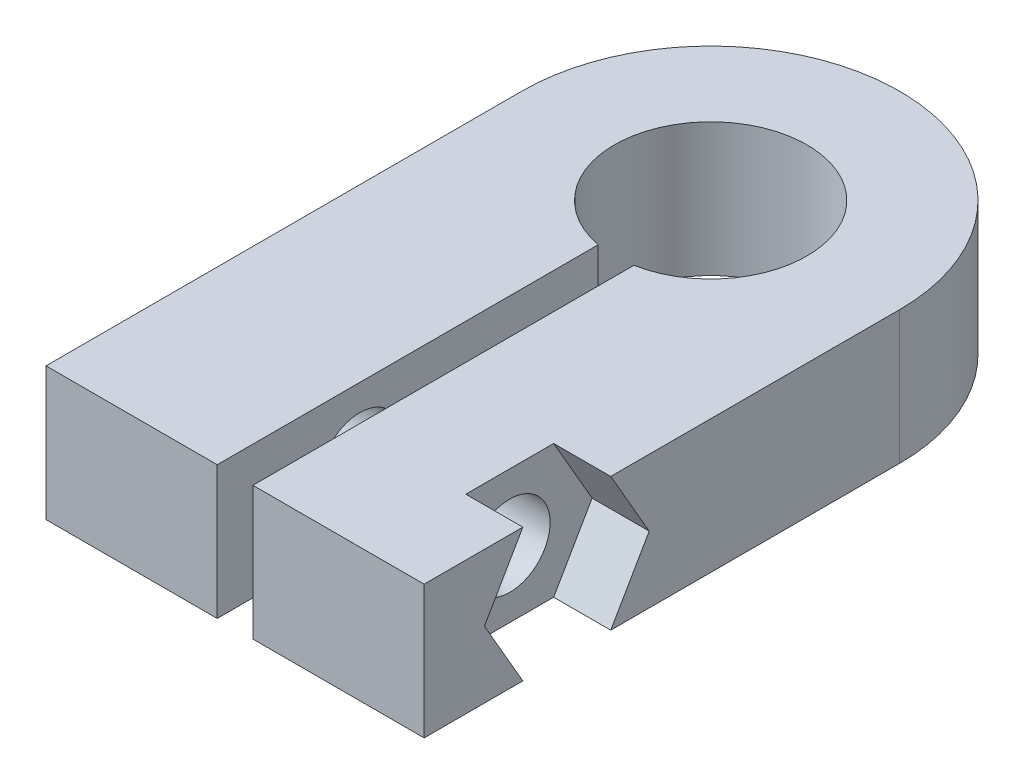
ISO-10303-21;
HEADER;
FILE_DESCRIPTION(('STEP AP214'),'2;1');
FILE_NAME('part.step','',(''),(''),'','','');
FILE_SCHEMA(('AUTOMOTIVE_DESIGN { 1 0 10303 214 1 1 1 1 }'));
ENDSEC;
DATA;
#1=APPLICATION_CONTEXT('core data for automotive mechanical design processes');
#2=APPLICATION_PROTOCOL_DEFINITION('international standard','automotive_design',2000,#1);
#3=PRODUCT_CONTEXT('',#1,'mechanical');
#4=PRODUCT('Part','Part','',(#3));
#5=PRODUCT_RELATED_PRODUCT_CATEGORY('part','',(#4));
#6=PRODUCT_DEFINITION_FORMATION('','',#4);
#7=PRODUCT_DEFINITION_CONTEXT('part definition',#1,'design');
#8=PRODUCT_DEFINITION('design','',#6,#7);
#9=PRODUCT_DEFINITION_SHAPE('','',#8);
#10=(LENGTH_UNIT() NAMED_UNIT(*) SI_UNIT(.MILLI.,.METRE.));
#11=(NAMED_UNIT(*) PLANE_ANGLE_UNIT() SI_UNIT($,.RADIAN.));
#12=(NAMED_UNIT(*) SI_UNIT($,.STERADIAN.) SOLID_ANGLE_UNIT());
#13=UNCERTAINTY_MEASURE_WITH_UNIT(LENGTH_MEASURE(1.E-05),#10,'distance_accuracy_value','');
#14=(GEOMETRIC_REPRESENTATION_CONTEXT(3) GLOBAL_UNCERTAINTY_ASSIGNED_CONTEXT((#13)) GLOBAL_UNIT_ASSIGNED_CONTEXT((#10,
#11,#12)) REPRESENTATION_CONTEXT('',''));
#15=CARTESIAN_POINT('',(0.,0.,0.));
#16=DIRECTION('',(0.,0.,1.));
#17=DIRECTION('',(1.,0.,0.));
#18=AXIS2_PLACEMENT_3D('',#15,#16,#17);
#19=CARTESIAN_POINT('',(7.95,5.6,0.));
#20=DIRECTION('',(-1.,0.,0.));
#21=DIRECTION('',(0.,0.,1.));
#22=AXIS2_PLACEMENT_3D('',#19,#20,#21);
#23=PLANE('',#22);
#24=DIRECTION('',(0.,0.,-1.));
#25=VECTOR('',#24,1.);
#26=CARTESIAN_POINT('',(7.95,0.,0.));
#27=LINE('',#26,#25);
#28=CARTESIAN_POINT('',(7.95,0.,20.));
#29=VERTEX_POINT('',#28);
#30=CARTESIAN_POINT('',(7.95,0.,15.8475208614068));
#31=VERTEX_POINT('',#30);
#32=EDGE_CURVE('E160',#29,#31,#27,.T.);
#33=ORIENTED_EDGE('',*,*,#32,.T.);
#34=DIRECTION('',(0.,-0.866025403784439,-0.5));
#35=VECTOR('',#34,1.);
#36=CARTESIAN_POINT('',(7.95,0.,15.8475208614068));
#37=LINE('',#36,#35);
#38=CARTESIAN_POINT('',(7.95,2.8,17.4641016151378));
#39=VERTEX_POINT('',#38);
#40=EDGE_CURVE('E231',#39,#31,#37,.T.);
#41=ORIENTED_EDGE('',*,*,#40,.F.);
#42=DIRECTION('',(0.,-0.866025403784439,0.5));
#43=VECTOR('',#42,1.);
#44=CARTESIAN_POINT('',(7.95,2.8,17.4641016151378));
#45=LINE('',#44,#43);
#46=CARTESIAN_POINT('',(7.95,5.6,15.8475208614068));
#47=VERTEX_POINT('',#46);
#48=EDGE_CURVE('E235',#47,#39,#45,.T.);
#49=ORIENTED_EDGE('',*,*,#48,.F.);
#50=DIRECTION('',(0.,0.,-1.));
#51=VECTOR('',#50,1.);
#52=CARTESIAN_POINT('',(7.95,5.6,0.));
#53=LINE('',#52,#51);
#54=CARTESIAN_POINT('',(7.95,5.6,20.));
#55=VERTEX_POINT('',#54);
#56=EDGE_CURVE('E128',#55,#47,#53,.T.);
#57=ORIENTED_EDGE('',*,*,#56,.F.);
#58=DIRECTION('',(0.,-1.,0.));
#59=VECTOR('',#58,1.);
#60=CARTESIAN_POINT('',(7.95,5.6,20.));
#61=LINE('',#60,#59);
#62=EDGE_CURVE('E139',#55,#29,#61,.T.);
#63=ORIENTED_EDGE('',*,*,#62,.T.);
#64=EDGE_LOOP('',(#33,#41,#49,#57,#63));
#65=FACE_BOUND('',#64,.T.);
#66=ADVANCED_FACE('F32',(#65),#23,.F.);
#67=CARTESIAN_POINT('',(-7.95,5.6,20.));
#68=DIRECTION('',(0.,0.,-1.));
#69=DIRECTION('',(-1.,0.,0.));
#70=AXIS2_PLACEMENT_3D('',#67,#68,#69);
#71=PLANE('',#70);
#72=DIRECTION('',(1.,0.,0.));
#73=VECTOR('',#72,1.);
#74=CARTESIAN_POINT('',(-7.95,0.,20.));
#75=LINE('',#74,#73);
#76=CARTESIAN_POINT('',(-7.95,0.,20.));
#77=VERTEX_POINT('',#76);
#78=CARTESIAN_POINT('',(-0.75,0.,20.));
#79=VERTEX_POINT('',#78);
#80=EDGE_CURVE('E148',#77,#79,#75,.T.);
#81=ORIENTED_EDGE('',*,*,#80,.T.);
#82=DIRECTION('',(0.,-1.,0.));
#83=VECTOR('',#82,1.);
#84=CARTESIAN_POINT('',(-0.75,5.6,20.));
#85=LINE('',#84,#83);
#86=CARTESIAN_POINT('',(-0.75,5.6,20.));
#87=VERTEX_POINT('',#86);
#88=EDGE_CURVE('E11',#87,#79,#85,.T.);
#89=ORIENTED_EDGE('',*,*,#88,.F.);
#90=DIRECTION('',(1.,0.,0.));
#91=VECTOR('',#90,1.);
#92=CARTESIAN_POINT('',(-7.95,5.6,20.));
#93=LINE('',#92,#91);
#94=CARTESIAN_POINT('',(-7.95,5.6,20.));
#95=VERTEX_POINT('',#94);
#96=EDGE_CURVE('E166',#95,#87,#93,.T.);
#97=ORIENTED_EDGE('',*,*,#96,.F.);
#98=DIRECTION('',(0.,-1.,0.));
#99=VECTOR('',#98,1.);
#100=CARTESIAN_POINT('',(-7.95,5.6,20.));
#101=LINE('',#100,#99);
#102=EDGE_CURVE('E144',#95,#77,#101,.T.);
#103=ORIENTED_EDGE('',*,*,#102,.T.);
#104=EDGE_LOOP('',(#81,#89,#97,#103));
#105=FACE_BOUND('',#104,.T.);
#106=ADVANCED_FACE('F34',(#105),#71,.F.);
#107=CARTESIAN_POINT('',(-0.75,5.6,20.));
#108=DIRECTION('',(-1.,0.,0.));
#109=DIRECTION('',(0.,0.,1.));
#110=AXIS2_PLACEMENT_3D('',#107,#108,#109);
#111=PLANE('',#110);
#112=CARTESIAN_POINT('',(-0.750000000000001,2.8,14.));
#113=DIRECTION('',(-1.,0.,0.));
#114=DIRECTION('',(0.,0.,1.));
#115=AXIS2_PLACEMENT_3D('',#112,#113,#114);
#116=CIRCLE('',#115,1.7);
#117=CARTESIAN_POINT('',(-0.750000000000001,2.8,15.7));
#118=VERTEX_POINT('',#117);
#119=EDGE_CURVE('E152',#118,#118,#116,.T.);
#120=ORIENTED_EDGE('',*,*,#119,.T.);
#121=EDGE_LOOP('',(#120));
#122=FACE_BOUND('',#121,.T.);
#123=DIRECTION('',(0.,0.,-1.));
#124=VECTOR('',#123,1.);
#125=CARTESIAN_POINT('',(-0.75,0.,20.));
#126=LINE('',#125,#124);
#127=CARTESIAN_POINT('',(-0.749999999999999,0.,3.97994974842648));
#128=VERTEX_POINT('',#127);
#129=EDGE_CURVE('E151',#79,#128,#126,.T.);
#130=ORIENTED_EDGE('',*,*,#129,.T.);
#131=DIRECTION('',(0.,-1.,0.));
#132=VECTOR('',#131,1.);
#133=CARTESIAN_POINT('',(-0.749999999999999,5.6,3.97994974842648));
#134=LINE('',#133,#132);
#135=CARTESIAN_POINT('',(-0.749999999999999,5.6,3.97994974842648));
#136=VERTEX_POINT('',#135);
#137=EDGE_CURVE('E41',#136,#128,#134,.T.);
#138=ORIENTED_EDGE('',*,*,#137,.F.);
#139=DIRECTION('',(0.,0.,-1.));
#140=VECTOR('',#139,1.);
#141=CARTESIAN_POINT('',(-0.75,5.6,20.));
#142=LINE('',#141,#140);
#143=EDGE_CURVE('E98',#87,#136,#142,.T.);
#144=ORIENTED_EDGE('',*,*,#143,.F.);
#145=ORIENTED_EDGE('',*,*,#88,.T.);
#146=EDGE_LOOP('',(#130,#138,#144,#145));
#147=FACE_BOUND('',#146,.T.);
#148=ADVANCED_FACE('F304',(#122,#147),#111,.F.);
#149=CARTESIAN_POINT('',(0.,5.6,0.));
#150=DIRECTION('',(0.,-1.,0.));
#151=DIRECTION('',(0.,0.,-1.));
#152=AXIS2_PLACEMENT_3D('',#149,#150,#151);
#153=CYLINDRICAL_SURFACE('',#152,4.05);
#154=CARTESIAN_POINT('',(0.,0.,0.));
#155=DIRECTION('',(0.,-1.,0.));
#156=DIRECTION('',(0.,0.,-1.));
#157=AXIS2_PLACEMENT_3D('',#154,#155,#156);
#158=CIRCLE('',#157,4.05);
#159=CARTESIAN_POINT('',(0.75,0.,3.97994974842648));
#160=VERTEX_POINT('',#159);
#161=EDGE_CURVE('E154',#128,#160,#158,.T.);
#162=ORIENTED_EDGE('',*,*,#161,.T.);
#163=DIRECTION('',(0.,-1.,0.));
#164=VECTOR('',#163,1.);
#165=CARTESIAN_POINT('',(0.75,5.6,3.97994974842648));
#166=LINE('',#165,#164);
#167=CARTESIAN_POINT('',(0.75,5.6,3.97994974842648));
#168=VERTEX_POINT('',#167);
#169=EDGE_CURVE('E174',#168,#160,#166,.T.);
#170=ORIENTED_EDGE('',*,*,#169,.F.);
#171=CARTESIAN_POINT('',(0.,5.6,0.));
#172=DIRECTION('',(0.,-1.,0.));
#173=DIRECTION('',(0.,0.,-1.));
#174=AXIS2_PLACEMENT_3D('',#171,#172,#173);
#175=CIRCLE('',#174,4.05);
#176=EDGE_CURVE('E183',#136,#168,#175,.T.);
#177=ORIENTED_EDGE('',*,*,#176,.F.);
#178=ORIENTED_EDGE('',*,*,#137,.T.);
#179=EDGE_LOOP('',(#162,#170,#177,#178));
#180=FACE_BOUND('',#179,.T.);
#181=ADVANCED_FACE('F181',(#180),#153,.F.);
#182=CARTESIAN_POINT('',(0.75,5.6,20.));
#183=DIRECTION('',(1.,0.,0.));
#184=DIRECTION('',(0.,0.,-1.));
#185=AXIS2_PLACEMENT_3D('',#182,#183,#184);
#186=PLANE('',#185);
#187=CARTESIAN_POINT('',(0.75,2.8,14.));
#188=DIRECTION('',(1.,0.,0.));
#189=DIRECTION('',(0.,0.,-1.));
#190=AXIS2_PLACEMENT_3D('',#187,#188,#189);
#191=CIRCLE('',#190,1.7);
#192=CARTESIAN_POINT('',(0.75,2.8,12.3));
#193=VERTEX_POINT('',#192);
#194=EDGE_CURVE('E208',#193,#193,#191,.T.);
#195=ORIENTED_EDGE('',*,*,#194,.T.);
#196=EDGE_LOOP('',(#195));
#197=FACE_BOUND('',#196,.T.);
#198=DIRECTION('',(0.,0.,1.));
#199=VECTOR('',#198,1.);
#200=CARTESIAN_POINT('',(0.75,0.,20.));
#201=LINE('',#200,#199);
#202=CARTESIAN_POINT('',(0.75,0.,20.));
#203=VERTEX_POINT('',#202);
#204=EDGE_CURVE('E156',#160,#203,#201,.T.);
#205=ORIENTED_EDGE('',*,*,#204,.T.);
#206=DIRECTION('',(0.,-1.,0.));
#207=VECTOR('',#206,1.);
#208=CARTESIAN_POINT('',(0.75,5.6,20.));
#209=LINE('',#208,#207);
#210=CARTESIAN_POINT('',(0.75,5.6,20.));
#211=VERTEX_POINT('',#210);
#212=EDGE_CURVE('E171',#211,#203,#209,.T.);
#213=ORIENTED_EDGE('',*,*,#212,.F.);
#214=DIRECTION('',(0.,0.,1.));
#215=VECTOR('',#214,1.);
#216=CARTESIAN_POINT('',(0.75,5.6,20.));
#217=LINE('',#216,#215);
#218=EDGE_CURVE('E200',#168,#211,#217,.T.);
#219=ORIENTED_EDGE('',*,*,#218,.F.);
#220=ORIENTED_EDGE('',*,*,#169,.T.);
#221=EDGE_LOOP('',(#205,#213,#219,#220));
#222=FACE_BOUND('',#221,.T.);
#223=ADVANCED_FACE('F193',(#197,#222),#186,.F.);
#224=CARTESIAN_POINT('',(7.95,5.6,20.));
#225=DIRECTION('',(0.,0.,-1.));
#226=DIRECTION('',(-1.,0.,0.));
#227=AXIS2_PLACEMENT_3D('',#224,#225,#226);
#228=PLANE('',#227);
#229=DIRECTION('',(1.,0.,0.));
#230=VECTOR('',#229,1.);
#231=CARTESIAN_POINT('',(7.95,0.,20.));
#232=LINE('',#231,#230);
#233=EDGE_CURVE('E158',#203,#29,#232,.T.);
#234=ORIENTED_EDGE('',*,*,#233,.T.);
#235=ORIENTED_EDGE('',*,*,#62,.F.);
#236=DIRECTION('',(1.,0.,0.));
#237=VECTOR('',#236,1.);
#238=CARTESIAN_POINT('',(7.95,5.6,20.));
#239=LINE('',#238,#237);
#240=EDGE_CURVE('E129',#211,#55,#239,.T.);
#241=ORIENTED_EDGE('',*,*,#240,.F.);
#242=ORIENTED_EDGE('',*,*,#212,.T.);
#243=EDGE_LOOP('',(#234,#235,#241,#242));
#244=FACE_BOUND('',#243,.T.);
#245=ADVANCED_FACE('F197',(#244),#228,.F.);
#246=DIRECTION('',(0.,0.866025403784439,0.5));
#247=VECTOR('',#246,1.);
#248=CARTESIAN_POINT('',(7.95,5.6,12.1524791385932));
#249=LINE('',#248,#247);
#250=CARTESIAN_POINT('',(7.95,2.8,10.5358983848623));
#251=VERTEX_POINT('',#250);
#252=CARTESIAN_POINT('',(7.95,5.6,12.1524791385932));
#253=VERTEX_POINT('',#252);
#254=EDGE_CURVE('E238',#251,#253,#249,.T.);
#255=ORIENTED_EDGE('',*,*,#254,.F.);
#256=DIRECTION('',(0.,0.866025403784439,-0.5));
#257=VECTOR('',#256,1.);
#258=CARTESIAN_POINT('',(7.95,2.8,10.5358983848623));
#259=LINE('',#258,#257);
#260=CARTESIAN_POINT('',(7.95,0.,12.1524791385932));
#261=VERTEX_POINT('',#260);
#262=EDGE_CURVE('E241',#261,#251,#259,.T.);
#263=ORIENTED_EDGE('',*,*,#262,.F.);
#264=CARTESIAN_POINT('',(7.95,0.,0.));
#265=VERTEX_POINT('',#264);
#266=EDGE_CURVE('E136',#261,#265,#27,.T.);
#267=ORIENTED_EDGE('',*,*,#266,.T.);
#268=DIRECTION('',(0.,-1.,0.));
#269=VECTOR('',#268,1.);
#270=CARTESIAN_POINT('',(7.95,5.6,0.));
#271=LINE('',#270,#269);
#272=CARTESIAN_POINT('',(7.95,5.6,0.));
#273=VERTEX_POINT('',#272);
#274=EDGE_CURVE('E132',#273,#265,#271,.T.);
#275=ORIENTED_EDGE('',*,*,#274,.F.);
#276=EDGE_CURVE('E115',#253,#273,#53,.T.);
#277=ORIENTED_EDGE('',*,*,#276,.F.);
#278=EDGE_LOOP('',(#255,#263,#267,#275,#277));
#279=FACE_BOUND('',#278,.T.);
#280=ADVANCED_FACE('F133',(#279),#23,.F.);
#281=CARTESIAN_POINT('',(0.,5.6,0.));
#282=DIRECTION('',(0.,-1.,0.));
#283=DIRECTION('',(0.,0.,-1.));
#284=AXIS2_PLACEMENT_3D('',#281,#282,#283);
#285=CYLINDRICAL_SURFACE('',#284,7.95);
#286=CARTESIAN_POINT('',(0.,0.,0.));
#287=DIRECTION('',(0.,1.,0.));
#288=DIRECTION('',(0.,0.,-1.));
#289=AXIS2_PLACEMENT_3D('',#286,#287,#288);
#290=CIRCLE('',#289,7.95);
#291=CARTESIAN_POINT('',(-7.95,0.,0.));
#292=VERTEX_POINT('',#291);
#293=EDGE_CURVE('E163',#265,#292,#290,.T.);
#294=ORIENTED_EDGE('',*,*,#293,.T.);
#295=DIRECTION('',(0.,-1.,0.));
#296=VECTOR('',#295,1.);
#297=CARTESIAN_POINT('',(-7.95,5.6,0.));
#298=LINE('',#297,#296);
#299=CARTESIAN_POINT('',(-7.95,5.6,0.));
#300=VERTEX_POINT('',#299);
#301=EDGE_CURVE('E140',#300,#292,#298,.T.);
#302=ORIENTED_EDGE('',*,*,#301,.F.);
#303=CARTESIAN_POINT('',(0.,5.6,0.));
#304=DIRECTION('',(0.,1.,0.));
#305=DIRECTION('',(0.,0.,-1.));
#306=AXIS2_PLACEMENT_3D('',#303,#304,#305);
#307=CIRCLE('',#306,7.95);
#308=EDGE_CURVE('E120',#273,#300,#307,.T.);
#309=ORIENTED_EDGE('',*,*,#308,.F.);
#310=ORIENTED_EDGE('',*,*,#274,.T.);
#311=EDGE_LOOP('',(#294,#302,#309,#310));
#312=FACE_BOUND('',#311,.T.);
#313=ADVANCED_FACE('F142',(#312),#285,.T.);
#314=CARTESIAN_POINT('',(-7.95,5.6,20.));
#315=DIRECTION('',(1.,0.,0.));
#316=DIRECTION('',(0.,0.,-1.));
#317=AXIS2_PLACEMENT_3D('',#314,#315,#316);
#318=PLANE('',#317);
#319=CARTESIAN_POINT('',(-7.95,2.8,14.));
#320=DIRECTION('',(-1.,0.,0.));
#321=DIRECTION('',(0.,0.,1.));
#322=AXIS2_PLACEMENT_3D('',#319,#320,#321);
#323=CIRCLE('',#322,1.7);
#324=CARTESIAN_POINT('',(-7.95,2.8,15.7));
#325=VERTEX_POINT('',#324);
#326=EDGE_CURVE('E211',#325,#325,#323,.T.);
#327=ORIENTED_EDGE('',*,*,#326,.F.);
#328=EDGE_LOOP('',(#327));
#329=FACE_BOUND('',#328,.T.);
#330=DIRECTION('',(0.,0.,1.));
#331=VECTOR('',#330,1.);
#332=CARTESIAN_POINT('',(-7.95,0.,20.));
#333=LINE('',#332,#331);
#334=EDGE_CURVE('E90',#292,#77,#333,.T.);
#335=ORIENTED_EDGE('',*,*,#334,.T.);
#336=ORIENTED_EDGE('',*,*,#102,.F.);
#337=DIRECTION('',(0.,0.,1.));
#338=VECTOR('',#337,1.);
#339=CARTESIAN_POINT('',(-7.95,5.6,20.));
#340=LINE('',#339,#338);
#341=EDGE_CURVE('E57',#300,#95,#340,.T.);
#342=ORIENTED_EDGE('',*,*,#341,.F.);
#343=ORIENTED_EDGE('',*,*,#301,.T.);
#344=EDGE_LOOP('',(#335,#336,#342,#343));
#345=FACE_BOUND('',#344,.T.);
#346=ADVANCED_FACE('F313',(#329,#345),#318,.F.);
#347=CARTESIAN_POINT('',(0.,5.6,0.));
#348=DIRECTION('',(0.,-1.,0.));
#349=DIRECTION('',(0.,0.,-1.));
#350=AXIS2_PLACEMENT_3D('',#347,#348,#349);
#351=PLANE('',#350);
#352=ORIENTED_EDGE('',*,*,#56,.T.);
#353=DIRECTION('',(1.,0.,0.));
#354=VECTOR('',#353,1.);
#355=CARTESIAN_POINT('',(5.55,5.6,15.8475208614068));
#356=LINE('',#355,#354);
#357=CARTESIAN_POINT('',(5.55,5.6,15.8475208614068));
#358=VERTEX_POINT('',#357);
#359=EDGE_CURVE('E219',#358,#47,#356,.T.);
#360=ORIENTED_EDGE('',*,*,#359,.F.);
#361=DIRECTION('',(0.,0.,1.));
#362=VECTOR('',#361,1.);
#363=CARTESIAN_POINT('',(5.55,5.6,15.8475208614068));
#364=LINE('',#363,#362);
#365=CARTESIAN_POINT('',(5.55,5.6,12.1524791385932));
#366=VERTEX_POINT('',#365);
#367=EDGE_CURVE('E248',#366,#358,#364,.T.);
#368=ORIENTED_EDGE('',*,*,#367,.F.);
#369=DIRECTION('',(1.,0.,0.));
#370=VECTOR('',#369,1.);
#371=CARTESIAN_POINT('',(5.55,5.6,12.1524791385932));
#372=LINE('',#371,#370);
#373=EDGE_CURVE('E125',#366,#253,#372,.T.);
#374=ORIENTED_EDGE('',*,*,#373,.T.);
#375=ORIENTED_EDGE('',*,*,#276,.T.);
#376=ORIENTED_EDGE('',*,*,#308,.T.);
#377=ORIENTED_EDGE('',*,*,#341,.T.);
#378=ORIENTED_EDGE('',*,*,#96,.T.);
#379=ORIENTED_EDGE('',*,*,#143,.T.);
#380=ORIENTED_EDGE('',*,*,#176,.T.);
#381=ORIENTED_EDGE('',*,*,#218,.T.);
#382=ORIENTED_EDGE('',*,*,#240,.T.);
#383=EDGE_LOOP('',(#352,#360,#368,#374,#375,#376,#377,#378,#379,#380,#381,#382));
#384=FACE_BOUND('',#383,.T.);
#385=ADVANCED_FACE('F118',(#384),#351,.F.);
#386=CARTESIAN_POINT('',(0.,0.,0.));
#387=DIRECTION('',(0.,-1.,0.));
#388=DIRECTION('',(0.,0.,-1.));
#389=AXIS2_PLACEMENT_3D('',#386,#387,#388);
#390=PLANE('',#389);
#391=DIRECTION('',(1.,0.,0.));
#392=VECTOR('',#391,1.);
#393=CARTESIAN_POINT('',(5.55,0.,12.1524791385932));
#394=LINE('',#393,#392);
#395=CARTESIAN_POINT('',(5.55,0.,12.1524791385932));
#396=VERTEX_POINT('',#395);
#397=EDGE_CURVE('E228',#396,#261,#394,.T.);
#398=ORIENTED_EDGE('',*,*,#397,.F.);
#399=DIRECTION('',(0.,0.,-1.));
#400=VECTOR('',#399,1.);
#401=CARTESIAN_POINT('',(5.55,0.,12.1524791385932));
#402=LINE('',#401,#400);
#403=CARTESIAN_POINT('',(5.55,0.,15.8475208614068));
#404=VERTEX_POINT('',#403);
#405=EDGE_CURVE('E217',#404,#396,#402,.T.);
#406=ORIENTED_EDGE('',*,*,#405,.F.);
#407=DIRECTION('',(1.,0.,0.));
#408=VECTOR('',#407,1.);
#409=CARTESIAN_POINT('',(5.55,0.,15.8475208614068));
#410=LINE('',#409,#408);
#411=EDGE_CURVE('E225',#404,#31,#410,.T.);
#412=ORIENTED_EDGE('',*,*,#411,.T.);
#413=ORIENTED_EDGE('',*,*,#32,.F.);
#414=ORIENTED_EDGE('',*,*,#233,.F.);
#415=ORIENTED_EDGE('',*,*,#204,.F.);
#416=ORIENTED_EDGE('',*,*,#161,.F.);
#417=ORIENTED_EDGE('',*,*,#129,.F.);
#418=ORIENTED_EDGE('',*,*,#80,.F.);
#419=ORIENTED_EDGE('',*,*,#334,.F.);
#420=ORIENTED_EDGE('',*,*,#293,.F.);
#421=ORIENTED_EDGE('',*,*,#266,.F.);
#422=EDGE_LOOP('',(#398,#406,#412,#413,#414,#415,#416,#417,#418,#419,#420,#421));
#423=FACE_BOUND('',#422,.T.);
#424=ADVANCED_FACE('F187',(#423),#390,.T.);
#425=CARTESIAN_POINT('',(7.95,2.8,14.));
#426=DIRECTION('',(-1.,0.,0.));
#427=DIRECTION('',(0.,0.,1.));
#428=AXIS2_PLACEMENT_3D('',#425,#426,#427);
#429=CYLINDRICAL_SURFACE('',#428,1.7);
#430=ORIENTED_EDGE('',*,*,#326,.T.);
#431=EDGE_LOOP('',(#430));
#432=FACE_BOUND('',#431,.T.);
#433=ORIENTED_EDGE('',*,*,#119,.F.);
#434=EDGE_LOOP('',(#433));
#435=FACE_BOUND('',#434,.T.);
#436=ADVANCED_FACE('F338',(#432,#435),#429,.F.);
#437=CARTESIAN_POINT('',(5.55,2.8,14.));
#438=DIRECTION('',(-1.,0.,0.));
#439=DIRECTION('',(0.,-1.,0.));
#440=AXIS2_PLACEMENT_3D('',#437,#438,#439);
#441=CIRCLE('',#440,1.7);
#442=CARTESIAN_POINT('',(5.55,1.1,14.));
#443=VERTEX_POINT('',#442);
#444=EDGE_CURVE('E36',#443,#443,#441,.F.);
#445=ORIENTED_EDGE('',*,*,#444,.T.);
#446=EDGE_LOOP('',(#445));
#447=FACE_BOUND('',#446,.T.);
#448=ORIENTED_EDGE('',*,*,#194,.F.);
#449=EDGE_LOOP('',(#448));
#450=FACE_BOUND('',#449,.T.);
#451=ADVANCED_FACE('F342',(#447,#450),#429,.F.);
#452=CARTESIAN_POINT('',(5.55,0.,0.));
#453=DIRECTION('',(-1.,0.,0.));
#454=DIRECTION('',(0.,-1.,0.));
#455=AXIS2_PLACEMENT_3D('',#452,#453,#454);
#456=PLANE('',#455);
#457=DIRECTION('',(0.,0.866025403784439,-0.5));
#458=VECTOR('',#457,1.);
#459=CARTESIAN_POINT('',(5.55,2.8,10.5358983848623));
#460=LINE('',#459,#458);
#461=CARTESIAN_POINT('',(5.55,2.8,10.5358983848623));
#462=VERTEX_POINT('',#461);
#463=EDGE_CURVE('E234',#396,#462,#460,.T.);
#464=ORIENTED_EDGE('',*,*,#463,.T.);
#465=DIRECTION('',(0.,0.866025403784439,0.5));
#466=VECTOR('',#465,1.);
#467=CARTESIAN_POINT('',(5.55,5.6,12.1524791385932));
#468=LINE('',#467,#466);
#469=EDGE_CURVE('E251',#462,#366,#468,.T.);
#470=ORIENTED_EDGE('',*,*,#469,.T.);
#471=ORIENTED_EDGE('',*,*,#367,.T.);
#472=DIRECTION('',(0.,-0.866025403784439,0.5));
#473=VECTOR('',#472,1.);
#474=CARTESIAN_POINT('',(5.55,2.8,17.4641016151378));
#475=LINE('',#474,#473);
#476=CARTESIAN_POINT('',(5.55,2.8,17.4641016151378));
#477=VERTEX_POINT('',#476);
#478=EDGE_CURVE('E246',#358,#477,#475,.T.);
#479=ORIENTED_EDGE('',*,*,#478,.T.);
#480=DIRECTION('',(0.,-0.866025403784439,-0.5));
#481=VECTOR('',#480,1.);
#482=CARTESIAN_POINT('',(5.55,0.,15.8475208614068));
#483=LINE('',#482,#481);
#484=EDGE_CURVE('E48',#477,#404,#483,.T.);
#485=ORIENTED_EDGE('',*,*,#484,.T.);
#486=ORIENTED_EDGE('',*,*,#405,.T.);
#487=EDGE_LOOP('',(#464,#470,#471,#479,#485,#486));
#488=FACE_BOUND('',#487,.T.);
#489=ORIENTED_EDGE('',*,*,#444,.F.);
#490=EDGE_LOOP('',(#489));
#491=FACE_BOUND('',#490,.T.);
#492=ADVANCED_FACE('F257',(#488,#491),#456,.F.);
#493=CARTESIAN_POINT('',(5.55,2.8,10.5358983848623));
#494=DIRECTION('',(0.,-0.5,-0.866025403784439));
#495=DIRECTION('',(0.,0.866025403784439,-0.5));
#496=AXIS2_PLACEMENT_3D('',#493,#494,#495);
#497=PLANE('',#496);
#498=ORIENTED_EDGE('',*,*,#262,.T.);
#499=DIRECTION('',(1.,0.,0.));
#500=VECTOR('',#499,1.);
#501=CARTESIAN_POINT('',(5.55,2.8,10.5358983848623));
#502=LINE('',#501,#500);
#503=EDGE_CURVE('E214',#462,#251,#502,.T.);
#504=ORIENTED_EDGE('',*,*,#503,.F.);
#505=ORIENTED_EDGE('',*,*,#463,.F.);
#506=ORIENTED_EDGE('',*,*,#397,.T.);
#507=EDGE_LOOP('',(#498,#504,#505,#506));
#508=FACE_BOUND('',#507,.T.);
#509=ADVANCED_FACE('F265',(#508),#497,.F.);
#510=CARTESIAN_POINT('',(5.55,0.,15.8475208614068));
#511=DIRECTION('',(0.,-0.5,0.866025403784439));
#512=DIRECTION('',(0.,-0.866025403784439,-0.5));
#513=AXIS2_PLACEMENT_3D('',#510,#511,#512);
#514=PLANE('',#513);
#515=ORIENTED_EDGE('',*,*,#40,.T.);
#516=ORIENTED_EDGE('',*,*,#411,.F.);
#517=ORIENTED_EDGE('',*,*,#484,.F.);
#518=DIRECTION('',(1.,0.,0.));
#519=VECTOR('',#518,1.);
#520=CARTESIAN_POINT('',(5.55,2.8,17.4641016151378));
#521=LINE('',#520,#519);
#522=EDGE_CURVE('E222',#477,#39,#521,.T.);
#523=ORIENTED_EDGE('',*,*,#522,.T.);
#524=EDGE_LOOP('',(#515,#516,#517,#523));
#525=FACE_BOUND('',#524,.T.);
#526=ADVANCED_FACE('F282',(#525),#514,.F.);
#527=CARTESIAN_POINT('',(5.55,2.8,17.4641016151378));
#528=DIRECTION('',(0.,0.5,0.866025403784439));
#529=DIRECTION('',(0.,-0.866025403784439,0.5));
#530=AXIS2_PLACEMENT_3D('',#527,#528,#529);
#531=PLANE('',#530);
#532=ORIENTED_EDGE('',*,*,#48,.T.);
#533=ORIENTED_EDGE('',*,*,#522,.F.);
#534=ORIENTED_EDGE('',*,*,#478,.F.);
#535=ORIENTED_EDGE('',*,*,#359,.T.);
#536=EDGE_LOOP('',(#532,#533,#534,#535));
#537=FACE_BOUND('',#536,.T.);
#538=ADVANCED_FACE('F288',(#537),#531,.F.);
#539=CARTESIAN_POINT('',(5.55,5.6,12.1524791385932));
#540=DIRECTION('',(0.,0.499999999999999,-0.866025403784439));
#541=DIRECTION('',(0.,0.866025403784439,0.5));
#542=AXIS2_PLACEMENT_3D('',#539,#540,#541);
#543=PLANE('',#542);
#544=ORIENTED_EDGE('',*,*,#254,.T.);
#545=ORIENTED_EDGE('',*,*,#373,.F.);
#546=ORIENTED_EDGE('',*,*,#469,.F.);
#547=ORIENTED_EDGE('',*,*,#503,.T.);
#548=EDGE_LOOP('',(#544,#545,#546,#547));
#549=FACE_BOUND('',#548,.T.);
#550=ADVANCED_FACE('F290',(#549),#543,.F.);
#551=CLOSED_SHELL('',(#66,#106,#148,#181,#223,#245,#280,#313,#346,#385,#424,#436,#451,#492,#509,
#526,#538,#550));
#552=MANIFOLD_SOLID_BREP('B2',#551);
#553=ADVANCED_BREP_SHAPE_REPRESENTATION('',(#18,#552),#14);
#554=SHAPE_DEFINITION_REPRESENTATION(#9,#553);
ENDSEC;
END-ISO-10303-21;
